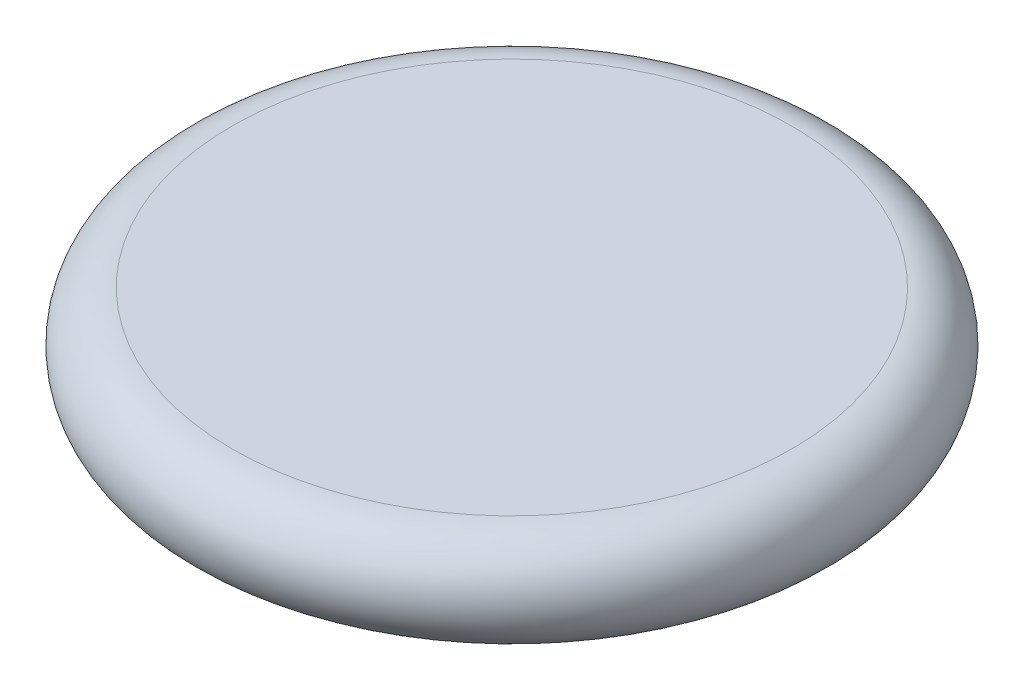
ISO-10303-21;
HEADER;
FILE_DESCRIPTION(('STEP AP214'),'2;1');
FILE_NAME('part.step','',(''),(''),'','','');
FILE_SCHEMA(('AUTOMOTIVE_DESIGN { 1 0 10303 214 1 1 1 1 }'));
ENDSEC;
DATA;
#1=APPLICATION_CONTEXT('core data for automotive mechanical design processes');
#2=APPLICATION_PROTOCOL_DEFINITION('international standard','automotive_design',2000,#1);
#3=PRODUCT_CONTEXT('',#1,'mechanical');
#4=PRODUCT('Part','Part','',(#3));
#5=PRODUCT_RELATED_PRODUCT_CATEGORY('part','',(#4));
#6=PRODUCT_DEFINITION_FORMATION('','',#4);
#7=PRODUCT_DEFINITION_CONTEXT('part definition',#1,'design');
#8=PRODUCT_DEFINITION('design','',#6,#7);
#9=PRODUCT_DEFINITION_SHAPE('','',#8);
#10=(LENGTH_UNIT() NAMED_UNIT(*) SI_UNIT(.MILLI.,.METRE.));
#11=(NAMED_UNIT(*) PLANE_ANGLE_UNIT() SI_UNIT($,.RADIAN.));
#12=(NAMED_UNIT(*) SI_UNIT($,.STERADIAN.) SOLID_ANGLE_UNIT());
#13=UNCERTAINTY_MEASURE_WITH_UNIT(LENGTH_MEASURE(1.E-05),#10,'distance_accuracy_value','');
#14=(GEOMETRIC_REPRESENTATION_CONTEXT(3) GLOBAL_UNCERTAINTY_ASSIGNED_CONTEXT((#13)) GLOBAL_UNIT_ASSIGNED_CONTEXT((#10,
#11,#12)) REPRESENTATION_CONTEXT('',''));
#15=CARTESIAN_POINT('',(0.,0.,0.));
#16=DIRECTION('',(0.,0.,1.));
#17=DIRECTION('',(1.,0.,0.));
#18=AXIS2_PLACEMENT_3D('',#15,#16,#17);
#19=CARTESIAN_POINT('',(0.,0.,0.));
#20=DIRECTION('',(0.,1.,0.));
#21=DIRECTION('',(0.,0.,1.));
#22=AXIS2_PLACEMENT_3D('',#19,#20,#21);
#23=TOROIDAL_SURFACE('',#22,65.8198741972612,11.7235682292456);
#24=CARTESIAN_POINT('',(0.,11.7235682292456,0.));
#25=DIRECTION('',(0.,1.,0.));
#26=DIRECTION('',(0.,0.,1.));
#27=AXIS2_PLACEMENT_3D('',#24,#25,#26);
#28=CIRCLE('',#27,65.8198741972612);
#29=CARTESIAN_POINT('',(0.,11.7235682292456,65.8198741972612));
#30=VERTEX_POINT('',#29);
#31=EDGE_CURVE('E10',#30,#30,#28,.T.);
#32=ORIENTED_EDGE('',*,*,#31,.F.);
#33=EDGE_LOOP('',(#32));
#34=FACE_BOUND('',#33,.T.);
#35=CARTESIAN_POINT('',(0.,-11.7235682292456,0.));
#36=DIRECTION('',(0.,1.,0.));
#37=DIRECTION('',(0.,0.,1.));
#38=AXIS2_PLACEMENT_3D('',#35,#36,#37);
#39=CIRCLE('',#38,65.8198741972612);
#40=CARTESIAN_POINT('',(0.,-11.7235682292456,65.8198741972612));
#41=VERTEX_POINT('',#40);
#42=EDGE_CURVE('E39',#41,#41,#39,.T.);
#43=ORIENTED_EDGE('',*,*,#42,.T.);
#44=EDGE_LOOP('',(#43));
#45=FACE_BOUND('',#44,.T.);
#46=ADVANCED_FACE('F33',(#34,#45),#23,.T.);
#47=CARTESIAN_POINT('',(65.8198741972612,11.7235682292456,0.));
#48=DIRECTION('',(0.,-1.,0.));
#49=DIRECTION('',(0.,0.,-1.));
#50=AXIS2_PLACEMENT_3D('',#47,#48,#49);
#51=PLANE('',#50);
#52=ORIENTED_EDGE('',*,*,#31,.T.);
#53=EDGE_LOOP('',(#52));
#54=FACE_BOUND('',#53,.T.);
#55=ADVANCED_FACE('F48',(#54),#51,.F.);
#56=CARTESIAN_POINT('',(65.8198741972612,-11.7235682292456,0.));
#57=DIRECTION('',(0.,1.,0.));
#58=DIRECTION('',(0.,0.,1.));
#59=AXIS2_PLACEMENT_3D('',#56,#57,#58);
#60=PLANE('',#59);
#61=ORIENTED_EDGE('',*,*,#42,.F.);
#62=EDGE_LOOP('',(#61));
#63=FACE_BOUND('',#62,.T.);
#64=ADVANCED_FACE('F46',(#63),#60,.F.);
#65=CLOSED_SHELL('',(#46,#55,#64));
#66=MANIFOLD_SOLID_BREP('B2',#65);
#67=ADVANCED_BREP_SHAPE_REPRESENTATION('',(#18,#66),#14);
#68=SHAPE_DEFINITION_REPRESENTATION(#9,#67);
ENDSEC;
END-ISO-10303-21;
